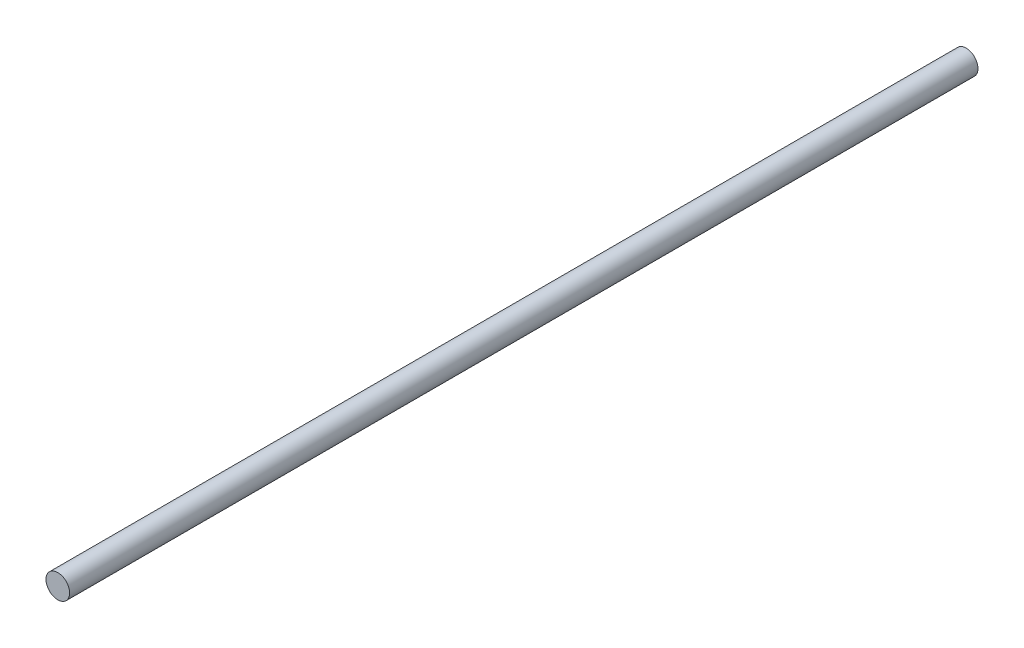
ISO-10303-21;
HEADER;
FILE_DESCRIPTION(('STEP AP214'),'2;1');
FILE_NAME('part.step','',(''),(''),'','','');
FILE_SCHEMA(('AUTOMOTIVE_DESIGN { 1 0 10303 214 1 1 1 1 }'));
ENDSEC;
DATA;
#1=APPLICATION_CONTEXT('core data for automotive mechanical design processes');
#2=APPLICATION_PROTOCOL_DEFINITION('international standard','automotive_design',2000,#1);
#3=PRODUCT_CONTEXT('',#1,'mechanical');
#4=PRODUCT('Part','Part','',(#3));
#5=PRODUCT_RELATED_PRODUCT_CATEGORY('part','',(#4));
#6=PRODUCT_DEFINITION_FORMATION('','',#4);
#7=PRODUCT_DEFINITION_CONTEXT('part definition',#1,'design');
#8=PRODUCT_DEFINITION('design','',#6,#7);
#9=PRODUCT_DEFINITION_SHAPE('','',#8);
#10=(LENGTH_UNIT() NAMED_UNIT(*) SI_UNIT(.MILLI.,.METRE.));
#11=(NAMED_UNIT(*) PLANE_ANGLE_UNIT() SI_UNIT($,.RADIAN.));
#12=(NAMED_UNIT(*) SI_UNIT($,.STERADIAN.) SOLID_ANGLE_UNIT());
#13=UNCERTAINTY_MEASURE_WITH_UNIT(LENGTH_MEASURE(1.E-05),#10,'distance_accuracy_value','');
#14=(GEOMETRIC_REPRESENTATION_CONTEXT(3) GLOBAL_UNCERTAINTY_ASSIGNED_CONTEXT((#13)) GLOBAL_UNIT_ASSIGNED_CONTEXT((#10,
#11,#12)) REPRESENTATION_CONTEXT('',''));
#15=CARTESIAN_POINT('',(0.,0.,0.));
#16=DIRECTION('',(0.,0.,1.));
#17=DIRECTION('',(1.,0.,0.));
#18=AXIS2_PLACEMENT_3D('',#15,#16,#17);
#19=CARTESIAN_POINT('',(0.,0.,304.8));
#20=DIRECTION('',(0.,0.,-1.));
#21=DIRECTION('',(-1.,0.,0.));
#22=AXIS2_PLACEMENT_3D('',#19,#20,#21);
#23=CYLINDRICAL_SURFACE('',#22,3.96875);
#24=CARTESIAN_POINT('',(0.,0.,304.8));
#25=DIRECTION('',(0.,0.,1.));
#26=DIRECTION('',(1.,0.,0.));
#27=AXIS2_PLACEMENT_3D('',#24,#25,#26);
#28=CIRCLE('',#27,3.96875);
#29=CARTESIAN_POINT('',(3.96875,0.,304.8));
#30=VERTEX_POINT('',#29);
#31=EDGE_CURVE('E10',#30,#30,#28,.T.);
#32=ORIENTED_EDGE('',*,*,#31,.F.);
#33=EDGE_LOOP('',(#32));
#34=FACE_BOUND('',#33,.T.);
#35=CARTESIAN_POINT('',(0.,0.,0.));
#36=DIRECTION('',(0.,0.,1.));
#37=DIRECTION('',(1.,0.,0.));
#38=AXIS2_PLACEMENT_3D('',#35,#36,#37);
#39=CIRCLE('',#38,3.96875);
#40=CARTESIAN_POINT('',(3.96875,0.,0.));
#41=VERTEX_POINT('',#40);
#42=EDGE_CURVE('E40',#41,#41,#39,.T.);
#43=ORIENTED_EDGE('',*,*,#42,.T.);
#44=EDGE_LOOP('',(#43));
#45=FACE_BOUND('',#44,.T.);
#46=ADVANCED_FACE('F37',(#34,#45),#23,.T.);
#47=CARTESIAN_POINT('',(0.,0.,304.8));
#48=DIRECTION('',(0.,0.,1.));
#49=DIRECTION('',(1.,0.,0.));
#50=AXIS2_PLACEMENT_3D('',#47,#48,#49);
#51=PLANE('',#50);
#52=ORIENTED_EDGE('',*,*,#31,.T.);
#53=EDGE_LOOP('',(#52));
#54=FACE_BOUND('',#53,.T.);
#55=ADVANCED_FACE('F54',(#54),#51,.T.);
#56=CARTESIAN_POINT('',(0.,0.,0.));
#57=DIRECTION('',(0.,0.,1.));
#58=DIRECTION('',(1.,0.,0.));
#59=AXIS2_PLACEMENT_3D('',#56,#57,#58);
#60=PLANE('',#59);
#61=ORIENTED_EDGE('',*,*,#42,.F.);
#62=EDGE_LOOP('',(#61));
#63=FACE_BOUND('',#62,.T.);
#64=ADVANCED_FACE('F52',(#63),#60,.F.);
#65=CLOSED_SHELL('',(#46,#55,#64));
#66=MANIFOLD_SOLID_BREP('B2',#65);
#67=ADVANCED_BREP_SHAPE_REPRESENTATION('',(#18,#66),#14);
#68=SHAPE_DEFINITION_REPRESENTATION(#9,#67);
ENDSEC;
END-ISO-10303-21;
